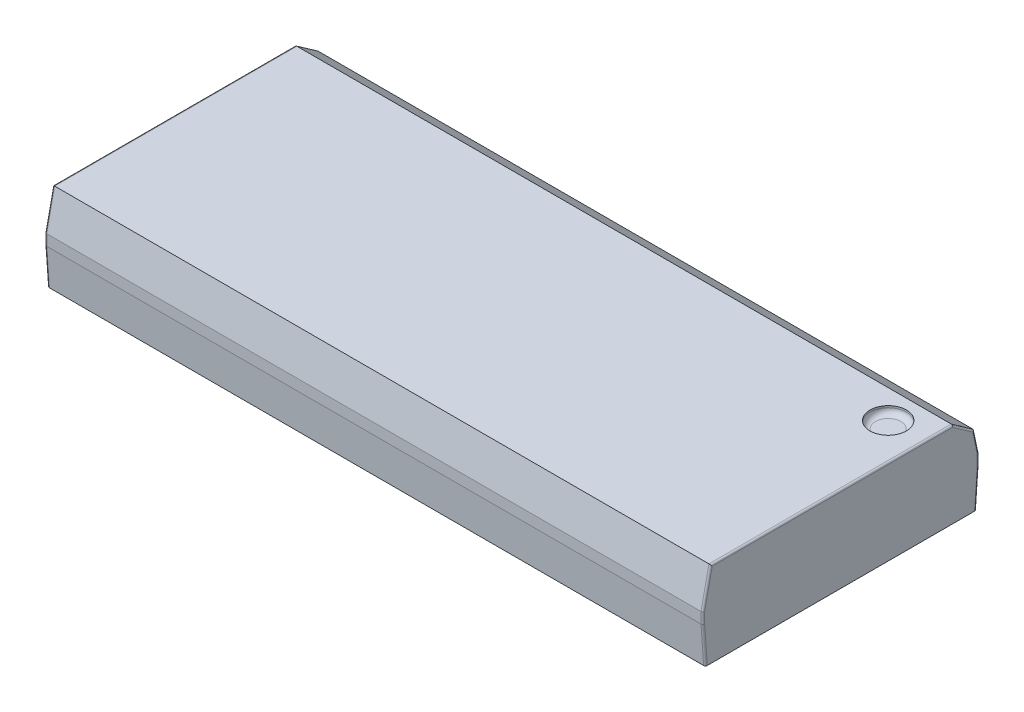
ISO-10303-21;
HEADER;
FILE_DESCRIPTION(('STEP AP214'),'2;1');
FILE_NAME('part.step','',(''),(''),'','','');
FILE_SCHEMA(('AUTOMOTIVE_DESIGN { 1 0 10303 214 1 1 1 1 }'));
ENDSEC;
DATA;
#1=APPLICATION_CONTEXT('core data for automotive mechanical design processes');
#2=APPLICATION_PROTOCOL_DEFINITION('international standard','automotive_design',2000,#1);
#3=PRODUCT_CONTEXT('',#1,'mechanical');
#4=PRODUCT('Part','Part','',(#3));
#5=PRODUCT_RELATED_PRODUCT_CATEGORY('part','',(#4));
#6=PRODUCT_DEFINITION_FORMATION('','',#4);
#7=PRODUCT_DEFINITION_CONTEXT('part definition',#1,'design');
#8=PRODUCT_DEFINITION('design','',#6,#7);
#9=PRODUCT_DEFINITION_SHAPE('','',#8);
#10=(LENGTH_UNIT() NAMED_UNIT(*) SI_UNIT(.MILLI.,.METRE.));
#11=(NAMED_UNIT(*) PLANE_ANGLE_UNIT() SI_UNIT($,.RADIAN.));
#12=(NAMED_UNIT(*) SI_UNIT($,.STERADIAN.) SOLID_ANGLE_UNIT());
#13=UNCERTAINTY_MEASURE_WITH_UNIT(LENGTH_MEASURE(1.E-05),#10,'distance_accuracy_value','');
#14=(GEOMETRIC_REPRESENTATION_CONTEXT(3) GLOBAL_UNCERTAINTY_ASSIGNED_CONTEXT((#13)) GLOBAL_UNIT_ASSIGNED_CONTEXT((#10,
#11,#12)) REPRESENTATION_CONTEXT('',''));
#15=CARTESIAN_POINT('',(0.,0.,0.));
#16=DIRECTION('',(0.,0.,1.));
#17=DIRECTION('',(1.,0.,0.));
#18=AXIS2_PLACEMENT_3D('',#15,#16,#17);
#19=CARTESIAN_POINT('',(8.05,0.975,-2.3));
#20=DIRECTION('',(0.,1.,0.));
#21=DIRECTION('',(0.,0.,1.));
#22=AXIS2_PLACEMENT_3D('',#19,#20,#21);
#23=PLANE('',#22);
#24=CARTESIAN_POINT('',(8.05,0.975,-2.3));
#25=DIRECTION('',(0.,-1.,0.));
#26=DIRECTION('',(0.,0.,-1.));
#27=AXIS2_PLACEMENT_3D('',#24,#25,#26);
#28=CIRCLE('',#27,0.350000000000004);
#29=CARTESIAN_POINT('',(8.05,0.975,-1.95));
#30=VERTEX_POINT('',#29);
#31=CARTESIAN_POINT('',(8.05,0.975,-2.65));
#32=VERTEX_POINT('',#31);
#33=EDGE_CURVE('E283',#30,#32,#28,.F.);
#34=ORIENTED_EDGE('',*,*,#33,.T.);
#35=CARTESIAN_POINT('',(8.05,0.975,-2.3));
#36=DIRECTION('',(0.,-1.,0.));
#37=DIRECTION('',(0.,0.,1.));
#38=AXIS2_PLACEMENT_3D('',#35,#36,#37);
#39=CIRCLE('',#38,0.350000000000005);
#40=EDGE_CURVE('E285',#32,#30,#39,.F.);
#41=ORIENTED_EDGE('',*,*,#40,.T.);
#42=EDGE_LOOP('',(#34,#41));
#43=FACE_BOUND('',#42,.T.);
#44=ADVANCED_FACE('F17',(#43),#23,.T.);
#45=CARTESIAN_POINT('',(8.05,1.125,-2.3));
#46=DIRECTION('',(0.,1.,0.));
#47=DIRECTION('',(0.,0.,1.));
#48=AXIS2_PLACEMENT_3D('',#45,#46,#47);
#49=TOROIDAL_SURFACE('',#48,0.350000000000004,0.15);
#50=CARTESIAN_POINT('',(8.05,1.125,-2.3));
#51=DIRECTION('',(0.,1.,0.));
#52=DIRECTION('',(0.,0.,1.));
#53=AXIS2_PLACEMENT_3D('',#50,#51,#52);
#54=CIRCLE('',#53,0.500000000000004);
#55=CARTESIAN_POINT('',(8.05,1.125,-1.8));
#56=VERTEX_POINT('',#55);
#57=EDGE_CURVE('E192',#56,#56,#54,.T.);
#58=ORIENTED_EDGE('',*,*,#57,.T.);
#59=EDGE_LOOP('',(#58));
#60=FACE_BOUND('',#59,.T.);
#61=ORIENTED_EDGE('',*,*,#40,.F.);
#62=ORIENTED_EDGE('',*,*,#33,.F.);
#63=EDGE_LOOP('',(#61,#62));
#64=FACE_BOUND('',#63,.T.);
#65=ADVANCED_FACE('F196',(#60,#64),#49,.F.);
#66=CARTESIAN_POINT('',(8.05,0.975,-2.3));
#67=DIRECTION('',(0.,1.,0.));
#68=DIRECTION('',(0.,0.,1.));
#69=AXIS2_PLACEMENT_3D('',#66,#67,#68);
#70=CYLINDRICAL_SURFACE('',#69,0.500000000000004);
#71=CARTESIAN_POINT('',(8.05,1.175,-2.3));
#72=DIRECTION('',(0.,1.,0.));
#73=DIRECTION('',(0.,0.,1.));
#74=AXIS2_PLACEMENT_3D('',#71,#72,#73);
#75=CIRCLE('',#74,0.500000000000004);
#76=CARTESIAN_POINT('',(8.05,1.175,-1.8));
#77=VERTEX_POINT('',#76);
#78=EDGE_CURVE('E179',#77,#77,#75,.F.);
#79=ORIENTED_EDGE('',*,*,#78,.F.);
#80=EDGE_LOOP('',(#79));
#81=FACE_BOUND('',#80,.T.);
#82=ORIENTED_EDGE('',*,*,#57,.F.);
#83=EDGE_LOOP('',(#82));
#84=FACE_BOUND('',#83,.T.);
#85=ADVANCED_FACE('F200',(#81,#84),#70,.F.);
#86=CARTESIAN_POINT('',(-9.05,1.175,-3.08212952428822));
#87=DIRECTION('',(0.,0.819152044288992,-0.573576436351045));
#88=DIRECTION('',(0.,0.573576436351045,0.819152044288992));
#89=AXIS2_PLACEMENT_3D('',#86,#87,#88);
#90=PLANE('',#89);
#91=DIRECTION('',(1.,0.,0.));
#92=VECTOR('',#91,1.);
#93=CARTESIAN_POINT('',(-9.05,1.175,-3.08212952428822));
#94=LINE('',#93,#92);
#95=CARTESIAN_POINT('',(9.00000000000001,1.175,-3.08212952428822));
#96=VERTEX_POINT('',#95);
#97=CARTESIAN_POINT('',(-9.,1.175,-3.08212952428822));
#98=VERTEX_POINT('',#97);
#99=EDGE_CURVE('E176',#96,#98,#94,.F.);
#100=ORIENTED_EDGE('',*,*,#99,.F.);
#101=DIRECTION('',(0.,0.573576436351045,0.819152044288992));
#102=VECTOR('',#101,1.);
#103=CARTESIAN_POINT('',(9.00000000000001,1.175,-3.08212952428822));
#104=LINE('',#103,#102);
#105=CARTESIAN_POINT('',(9.00000000000001,0.763677592272502,-3.66955880101262));
#106=VERTEX_POINT('',#105);
#107=EDGE_CURVE('E187',#96,#106,#104,.F.);
#108=ORIENTED_EDGE('',*,*,#107,.T.);
#109=DIRECTION('',(1.,0.,0.));
#110=VECTOR('',#109,1.);
#111=CARTESIAN_POINT('',(-9.05,0.763677592272502,-3.66955880101262));
#112=LINE('',#111,#110);
#113=CARTESIAN_POINT('',(-9.,0.763677592272502,-3.66955880101262));
#114=VERTEX_POINT('',#113);
#115=EDGE_CURVE('E184',#106,#114,#112,.F.);
#116=ORIENTED_EDGE('',*,*,#115,.T.);
#117=DIRECTION('',(0.,0.573576436351045,0.819152044288992));
#118=VECTOR('',#117,1.);
#119=CARTESIAN_POINT('',(-9.,1.175,-3.08212952428822));
#120=LINE('',#119,#118);
#121=EDGE_CURVE('E190',#114,#98,#120,.T.);
#122=ORIENTED_EDGE('',*,*,#121,.T.);
#123=EDGE_LOOP('',(#100,#108,#116,#122));
#124=FACE_BOUND('',#123,.T.);
#125=ADVANCED_FACE('F308',(#124),#90,.T.);
#126=CARTESIAN_POINT('',(-9.05,1.175,-3.58212952428823));
#127=DIRECTION('',(0.,-0.207911690817757,0.978147600733806));
#128=DIRECTION('',(0.,-0.978147600733806,-0.207911690817757));
#129=AXIS2_PLACEMENT_3D('',#126,#127,#128);
#130=PLANE('',#129);
#131=DIRECTION('',(0.,-0.978147600733806,-0.207911690817757));
#132=VECTOR('',#131,1.);
#133=CARTESIAN_POINT('',(-9.,1.175,-3.58212952428823));
#134=LINE('',#133,#132);
#135=CARTESIAN_POINT('',(-9.,0.149999999999988,-3.8));
#136=VERTEX_POINT('',#135);
#137=EDGE_CURVE('E182',#114,#136,#134,.T.);
#138=ORIENTED_EDGE('',*,*,#137,.F.);
#139=ORIENTED_EDGE('',*,*,#115,.F.);
#140=DIRECTION('',(0.,-0.978147600733806,-0.207911690817757));
#141=VECTOR('',#140,1.);
#142=CARTESIAN_POINT('',(9.,-1.11772386568823,-4.06946302603771));
#143=LINE('',#142,#141);
#144=CARTESIAN_POINT('',(9.,0.149999999999988,-3.8));
#145=VERTEX_POINT('',#144);
#146=EDGE_CURVE('E149',#145,#106,#143,.F.);
#147=ORIENTED_EDGE('',*,*,#146,.F.);
#148=DIRECTION('',(-1.,0.,0.));
#149=VECTOR('',#148,1.);
#150=CARTESIAN_POINT('',(-9.05,0.149999999999988,-3.8));
#151=LINE('',#150,#149);
#152=EDGE_CURVE('E171',#136,#145,#151,.F.);
#153=ORIENTED_EDGE('',*,*,#152,.F.);
#154=EDGE_LOOP('',(#138,#139,#147,#153));
#155=FACE_BOUND('',#154,.T.);
#156=ADVANCED_FACE('F314',(#155),#130,.F.);
#157=CARTESIAN_POINT('',(-9.05,1.175,3.8));
#158=DIRECTION('',(0.,1.,0.));
#159=DIRECTION('',(0.,0.,1.));
#160=AXIS2_PLACEMENT_3D('',#157,#158,#159);
#161=PLANE('',#160);
#162=DIRECTION('',(1.,0.,0.));
#163=VECTOR('',#162,1.);
#164=CARTESIAN_POINT('',(-9.05,1.175,3.58212952428823));
#165=LINE('',#164,#163);
#166=CARTESIAN_POINT('',(-9.,1.175,3.58212952428823));
#167=VERTEX_POINT('',#166);
#168=CARTESIAN_POINT('',(9.00000000000001,1.175,3.58212952428823));
#169=VERTEX_POINT('',#168);
#170=EDGE_CURVE('E165',#167,#169,#165,.T.);
#171=ORIENTED_EDGE('',*,*,#170,.T.);
#172=DIRECTION('',(0.,0.,-1.));
#173=VECTOR('',#172,1.);
#174=CARTESIAN_POINT('',(9.00000000000001,1.175,3.8));
#175=LINE('',#174,#173);
#176=EDGE_CURVE('E161',#96,#169,#175,.F.);
#177=ORIENTED_EDGE('',*,*,#176,.F.);
#178=ORIENTED_EDGE('',*,*,#99,.T.);
#179=DIRECTION('',(0.,0.,1.));
#180=VECTOR('',#179,1.);
#181=CARTESIAN_POINT('',(-9.,1.175,3.8));
#182=LINE('',#181,#180);
#183=EDGE_CURVE('E265',#167,#98,#182,.F.);
#184=ORIENTED_EDGE('',*,*,#183,.F.);
#185=EDGE_LOOP('',(#171,#177,#178,#184));
#186=FACE_BOUND('',#185,.T.);
#187=ORIENTED_EDGE('',*,*,#78,.T.);
#188=EDGE_LOOP('',(#187));
#189=FACE_BOUND('',#188,.T.);
#190=ADVANCED_FACE('F409',(#186,#189),#161,.T.);
#191=CARTESIAN_POINT('',(-9.05,1.175,3.58212952428823));
#192=DIRECTION('',(0.,-0.207911690817757,-0.978147600733806));
#193=DIRECTION('',(0.,0.978147600733806,-0.207911690817757));
#194=AXIS2_PLACEMENT_3D('',#191,#192,#193);
#195=PLANE('',#194);
#196=DIRECTION('',(0.,-0.978147600733806,0.207911690817757));
#197=VECTOR('',#196,1.);
#198=CARTESIAN_POINT('',(-9.,0.427875377999797,3.7409357650796));
#199=LINE('',#198,#197);
#200=CARTESIAN_POINT('',(-9.,0.149999999999991,3.8));
#201=VERTEX_POINT('',#200);
#202=EDGE_CURVE('E269',#201,#167,#199,.F.);
#203=ORIENTED_EDGE('',*,*,#202,.F.);
#204=DIRECTION('',(1.,0.,0.));
#205=VECTOR('',#204,1.);
#206=CARTESIAN_POINT('',(-9.05,0.149999999999988,3.8));
#207=LINE('',#206,#205);
#208=CARTESIAN_POINT('',(9.,0.149999999999988,3.8));
#209=VERTEX_POINT('',#208);
#210=EDGE_CURVE('E166',#209,#201,#207,.F.);
#211=ORIENTED_EDGE('',*,*,#210,.F.);
#212=DIRECTION('',(0.,0.978147600733806,-0.207911690817757));
#213=VECTOR('',#212,1.);
#214=CARTESIAN_POINT('',(9.,0.427875377999797,3.7409357650796));
#215=LINE('',#214,#213);
#216=EDGE_CURVE('E271',#169,#209,#215,.F.);
#217=ORIENTED_EDGE('',*,*,#216,.F.);
#218=ORIENTED_EDGE('',*,*,#170,.F.);
#219=EDGE_LOOP('',(#203,#211,#217,#218));
#220=FACE_BOUND('',#219,.T.);
#221=ADVANCED_FACE('F405',(#220),#195,.F.);
#222=CARTESIAN_POINT('',(9.,-1.175,3.75));
#223=DIRECTION('',(0.,1.,0.));
#224=DIRECTION('',(0.,0.,1.));
#225=AXIS2_PLACEMENT_3D('',#222,#223,#224);
#226=CYLINDRICAL_SURFACE('',#225,0.0500000000000001);
#227=CARTESIAN_POINT('',(9.,0.144744788236704,3.75));
#228=DIRECTION('',(0.,0.994521895368273,-0.104528463267652));
#229=DIRECTION('',(0.,-0.104528463267652,-0.994521895368273));
#230=AXIS2_PLACEMENT_3D('',#227,#228,#229);
#231=ELLIPSE('',#230,0.0502754139781759,0.0500000000000001);
#232=CARTESIAN_POINT('',(9.05,0.144744788236703,3.75));
#233=VERTEX_POINT('',#232);
#234=EDGE_CURVE('E275',#209,#233,#231,.T.);
#235=ORIENTED_EDGE('',*,*,#234,.F.);
#236=DIRECTION('',(0.,1.,0.));
#237=VECTOR('',#236,1.);
#238=CARTESIAN_POINT('',(9.,-1.175,3.8));
#239=LINE('',#238,#237);
#240=CARTESIAN_POINT('',(9.,-0.149999999999946,3.8));
#241=VERTEX_POINT('',#240);
#242=EDGE_CURVE('E250',#241,#209,#239,.T.);
#243=ORIENTED_EDGE('',*,*,#242,.F.);
#244=CARTESIAN_POINT('',(9.,-0.148253961525348,3.75));
#245=DIRECTION('',(0.,-0.999390827019096,-0.0348994967024992));
#246=DIRECTION('',(0.,0.0348994967024971,-0.999390827019096));
#247=AXIS2_PLACEMENT_3D('',#244,#245,#246);
#248=ELLIPSE('',#247,0.0500304772149412,0.0500000000000001);
#249=CARTESIAN_POINT('',(9.05,-0.148253961525368,3.75));
#250=VERTEX_POINT('',#249);
#251=EDGE_CURVE('E247',#250,#241,#248,.T.);
#252=ORIENTED_EDGE('',*,*,#251,.F.);
#253=DIRECTION('',(0.,1.,0.));
#254=VECTOR('',#253,1.);
#255=CARTESIAN_POINT('',(9.05,-1.175,3.75));
#256=LINE('',#255,#254);
#257=EDGE_CURVE('E249',#233,#250,#256,.F.);
#258=ORIENTED_EDGE('',*,*,#257,.F.);
#259=EDGE_LOOP('',(#235,#243,#252,#258));
#260=FACE_BOUND('',#259,.T.);
#261=ADVANCED_FACE('F402',(#260),#226,.T.);
#262=CARTESIAN_POINT('',(9.,-1.12811945022911,-4.02055564600102));
#263=DIRECTION('',(0.,-0.978147600733806,-0.207911690817757));
#264=DIRECTION('',(0.,0.207911690817757,-0.978147600733806));
#265=AXIS2_PLACEMENT_3D('',#262,#263,#264);
#266=CYLINDRICAL_SURFACE('',#265,0.0500000000000001);
#267=CARTESIAN_POINT('',(9.,0.734016878400281,-3.62474635062672));
#268=DIRECTION('',(0.,0.833885822067169,0.551936985312057));
#269=DIRECTION('',(0.,-0.551936985312057,0.833885822067169));
#270=AXIS2_PLACEMENT_3D('',#267,#268,#269);
#271=ELLIPSE('',#270,0.0537393120257227,0.0500000000000001);
#272=CARTESIAN_POINT('',(9.05,0.734016878400281,-3.62474635062672));
#273=VERTEX_POINT('',#272);
#274=EDGE_CURVE('E147',#273,#106,#271,.T.);
#275=ORIENTED_EDGE('',*,*,#274,.F.);
#276=DIRECTION('',(0.,0.978147600733806,0.207911690817757));
#277=VECTOR('',#276,1.);
#278=CARTESIAN_POINT('',(9.05,0.144744788236703,-3.75));
#279=LINE('',#278,#277);
#280=CARTESIAN_POINT('',(9.05,0.144744788236699,-3.75));
#281=VERTEX_POINT('',#280);
#282=EDGE_CURVE('E133',#281,#273,#279,.T.);
#283=ORIENTED_EDGE('',*,*,#282,.F.);
#284=CARTESIAN_POINT('',(9.,0.144744788236703,-3.75));
#285=DIRECTION('',(0.,0.994521895368273,0.104528463267652));
#286=DIRECTION('',(0.,0.104528463267652,-0.994521895368273));
#287=AXIS2_PLACEMENT_3D('',#284,#285,#286);
#288=ELLIPSE('',#287,0.0502754139781759,0.0500000000000001);
#289=EDGE_CURVE('E175',#145,#281,#288,.F.);
#290=ORIENTED_EDGE('',*,*,#289,.F.);
#291=ORIENTED_EDGE('',*,*,#146,.T.);
#292=EDGE_LOOP('',(#275,#283,#290,#291));
#293=FACE_BOUND('',#292,.T.);
#294=ADVANCED_FACE('F148',(#293),#266,.T.);
#295=CARTESIAN_POINT('',(9.,0.0236272718400006,-4.63928785124611));
#296=DIRECTION('',(0.,0.573576436351045,0.819152044288992));
#297=DIRECTION('',(0.,-0.819152044288992,0.573576436351045));
#298=AXIS2_PLACEMENT_3D('',#295,#296,#297);
#299=CYLINDRICAL_SURFACE('',#298,0.05);
#300=CARTESIAN_POINT('',(9.00000000000001,1.125,-3.06636458484427));
#301=DIRECTION('',(0.,-0.300705799504273,-0.953716950748227));
#302=DIRECTION('',(0.,0.953716950748227,-0.300705799504272));
#303=AXIS2_PLACEMENT_3D('',#300,#301,#302);
#304=ELLIPSE('',#303,0.0524264562570404,0.0499999999999998);
#305=CARTESIAN_POINT('',(9.05,1.125,-3.06636458484427));
#306=VERTEX_POINT('',#305);
#307=EDGE_CURVE('E151',#306,#96,#304,.F.);
#308=ORIENTED_EDGE('',*,*,#307,.F.);
#309=DIRECTION('',(0.,0.573576436351046,0.819152044288992));
#310=VECTOR('',#309,1.);
#311=CARTESIAN_POINT('',(9.05,0.734016878400281,-3.62474635062672));
#312=LINE('',#311,#310);
#313=EDGE_CURVE('E137',#273,#306,#312,.T.);
#314=ORIENTED_EDGE('',*,*,#313,.F.);
#315=ORIENTED_EDGE('',*,*,#274,.T.);
#316=ORIENTED_EDGE('',*,*,#107,.F.);
#317=EDGE_LOOP('',(#308,#314,#315,#316));
#318=FACE_BOUND('',#317,.T.);
#319=ADVANCED_FACE('F153',(#318),#299,.T.);
#320=CARTESIAN_POINT('',(9.00000000000001,1.125,3.8));
#321=DIRECTION('',(0.,0.,-1.));
#322=DIRECTION('',(-1.,0.,0.));
#323=AXIS2_PLACEMENT_3D('',#320,#321,#322);
#324=CYLINDRICAL_SURFACE('',#323,0.0499999999999997);
#325=ORIENTED_EDGE('',*,*,#307,.T.);
#326=ORIENTED_EDGE('',*,*,#176,.T.);
#327=CARTESIAN_POINT('',(9.00000000000001,1.125,3.54164032262848));
#328=DIRECTION('',(0.,0.629320391049839,-0.77714596145697));
#329=DIRECTION('',(0.,0.77714596145697,0.629320391049839));
#330=AXIS2_PLACEMENT_3D('',#327,#328,#329);
#331=ELLIPSE('',#330,0.0643379782946583,0.0499999999999999);
#332=CARTESIAN_POINT('',(9.05,1.125,3.54164032262848));
#333=VERTEX_POINT('',#332);
#334=EDGE_CURVE('E272',#333,#169,#331,.F.);
#335=ORIENTED_EDGE('',*,*,#334,.F.);
#336=DIRECTION('',(0.,0.,-1.));
#337=VECTOR('',#336,1.);
#338=CARTESIAN_POINT('',(9.05,1.125,-3.8));
#339=LINE('',#338,#337);
#340=EDGE_CURVE('E156',#306,#333,#339,.F.);
#341=ORIENTED_EDGE('',*,*,#340,.F.);
#342=EDGE_LOOP('',(#325,#326,#335,#341));
#343=FACE_BOUND('',#342,.T.);
#344=ADVANCED_FACE('F393',(#343),#324,.T.);
#345=CARTESIAN_POINT('',(9.,0.417479793458909,3.69202838504291));
#346=DIRECTION('',(0.,0.978147600733806,-0.207911690817757));
#347=DIRECTION('',(0.,0.207911690817757,0.978147600733806));
#348=AXIS2_PLACEMENT_3D('',#345,#346,#347);
#349=CYLINDRICAL_SURFACE('',#348,0.0500000000000001);
#350=ORIENTED_EDGE('',*,*,#334,.T.);
#351=ORIENTED_EDGE('',*,*,#216,.T.);
#352=ORIENTED_EDGE('',*,*,#234,.T.);
#353=DIRECTION('',(0.,-0.978147600733806,0.207911690817756));
#354=VECTOR('',#353,1.);
#355=CARTESIAN_POINT('',(9.05,1.125,3.54164032262848));
#356=LINE('',#355,#354);
#357=EDGE_CURVE('E158',#333,#233,#356,.T.);
#358=ORIENTED_EDGE('',*,*,#357,.F.);
#359=EDGE_LOOP('',(#350,#351,#352,#358));
#360=FACE_BOUND('',#359,.T.);
#361=ADVANCED_FACE('F389',(#360),#349,.T.);
#362=CARTESIAN_POINT('',(9.,-1.175,-3.75));
#363=DIRECTION('',(0.,1.,0.));
#364=DIRECTION('',(0.,0.,1.));
#365=AXIS2_PLACEMENT_3D('',#362,#363,#364);
#366=CYLINDRICAL_SURFACE('',#365,0.0500000000000001);
#367=ORIENTED_EDGE('',*,*,#289,.T.);
#368=DIRECTION('',(0.,1.,0.));
#369=VECTOR('',#368,1.);
#370=CARTESIAN_POINT('',(9.05,-1.175,-3.75));
#371=LINE('',#370,#369);
#372=CARTESIAN_POINT('',(9.05,-0.148253961525368,-3.75));
#373=VERTEX_POINT('',#372);
#374=EDGE_CURVE('E141',#373,#281,#371,.T.);
#375=ORIENTED_EDGE('',*,*,#374,.F.);
#376=CARTESIAN_POINT('',(9.,-0.148253961525367,-3.75));
#377=DIRECTION('',(0.,0.999390827019096,-0.0348994967024992));
#378=DIRECTION('',(0.,-0.0348994967024971,-0.999390827019096));
#379=AXIS2_PLACEMENT_3D('',#376,#377,#378);
#380=ELLIPSE('',#379,0.0500304772149412,0.0500000000000001);
#381=CARTESIAN_POINT('',(9.,-0.149999999999953,-3.8));
#382=VERTEX_POINT('',#381);
#383=EDGE_CURVE('E244',#382,#373,#380,.F.);
#384=ORIENTED_EDGE('',*,*,#383,.F.);
#385=DIRECTION('',(0.,1.,0.));
#386=VECTOR('',#385,1.);
#387=CARTESIAN_POINT('',(9.,-1.175,-3.8));
#388=LINE('',#387,#386);
#389=EDGE_CURVE('E174',#145,#382,#388,.F.);
#390=ORIENTED_EDGE('',*,*,#389,.F.);
#391=EDGE_LOOP('',(#367,#375,#384,#390));
#392=FACE_BOUND('',#391,.T.);
#393=ADVANCED_FACE('F385',(#392),#366,.T.);
#394=CARTESIAN_POINT('',(-9.05,-1.175,-3.8));
#395=DIRECTION('',(0.,0.,-1.));
#396=DIRECTION('',(-1.,0.,0.));
#397=AXIS2_PLACEMENT_3D('',#394,#395,#396);
#398=PLANE('',#397);
#399=ORIENTED_EDGE('',*,*,#152,.T.);
#400=ORIENTED_EDGE('',*,*,#389,.T.);
#401=DIRECTION('',(1.,0.,0.));
#402=VECTOR('',#401,1.);
#403=CARTESIAN_POINT('',(-9.05,-0.149999999999957,-3.8));
#404=LINE('',#403,#402);
#405=CARTESIAN_POINT('',(-9.,-0.149999999999953,-3.8));
#406=VERTEX_POINT('',#405);
#407=EDGE_CURVE('E445',#406,#382,#404,.T.);
#408=ORIENTED_EDGE('',*,*,#407,.F.);
#409=DIRECTION('',(0.,1.,0.));
#410=VECTOR('',#409,1.);
#411=CARTESIAN_POINT('',(-9.,-1.175,-3.8));
#412=LINE('',#411,#410);
#413=EDGE_CURVE('E255',#136,#406,#412,.F.);
#414=ORIENTED_EDGE('',*,*,#413,.F.);
#415=EDGE_LOOP('',(#399,#400,#408,#414));
#416=FACE_BOUND('',#415,.T.);
#417=ADVANCED_FACE('F381',(#416),#398,.T.);
#418=CARTESIAN_POINT('',(-9.,0.417479793458909,3.69202838504291));
#419=DIRECTION('',(0.,-0.978147600733806,0.207911690817757));
#420=DIRECTION('',(0.,-0.207911690817757,-0.978147600733806));
#421=AXIS2_PLACEMENT_3D('',#418,#419,#420);
#422=CYLINDRICAL_SURFACE('',#421,0.0500000000000001);
#423=CARTESIAN_POINT('',(-9.,1.125,3.54164032262848));
#424=DIRECTION('',(0.,-0.629320391049839,0.77714596145697));
#425=DIRECTION('',(0.,0.77714596145697,0.629320391049839));
#426=AXIS2_PLACEMENT_3D('',#423,#424,#425);
#427=ELLIPSE('',#426,0.0643379782946583,0.0499999999999999);
#428=CARTESIAN_POINT('',(-9.05,1.125,3.54164032262848));
#429=VERTEX_POINT('',#428);
#430=EDGE_CURVE('E266',#429,#167,#427,.F.);
#431=ORIENTED_EDGE('',*,*,#430,.F.);
#432=DIRECTION('',(0.,0.978147600733806,-0.207911690817756));
#433=VECTOR('',#432,1.);
#434=CARTESIAN_POINT('',(-9.05,0.144744788236709,3.75));
#435=LINE('',#434,#433);
#436=CARTESIAN_POINT('',(-9.05,0.14474478823671,3.75));
#437=VERTEX_POINT('',#436);
#438=EDGE_CURVE('E450',#437,#429,#435,.T.);
#439=ORIENTED_EDGE('',*,*,#438,.F.);
#440=CARTESIAN_POINT('',(-9.,0.144744788236711,3.75));
#441=DIRECTION('',(0.,0.994521895368273,-0.104528463267652));
#442=DIRECTION('',(0.,0.104528463267652,0.994521895368273));
#443=AXIS2_PLACEMENT_3D('',#440,#441,#442);
#444=ELLIPSE('',#443,0.0502754139781759,0.0500000000000001);
#445=EDGE_CURVE('E170',#201,#437,#444,.F.);
#446=ORIENTED_EDGE('',*,*,#445,.F.);
#447=ORIENTED_EDGE('',*,*,#202,.T.);
#448=EDGE_LOOP('',(#431,#439,#446,#447));
#449=FACE_BOUND('',#448,.T.);
#450=ADVANCED_FACE('F377',(#449),#422,.T.);
#451=CARTESIAN_POINT('',(-9.,1.125,3.8));
#452=DIRECTION('',(0.,0.,1.));
#453=DIRECTION('',(1.,0.,0.));
#454=AXIS2_PLACEMENT_3D('',#451,#452,#453);
#455=CYLINDRICAL_SURFACE('',#454,0.0499999999999997);
#456=ORIENTED_EDGE('',*,*,#430,.T.);
#457=ORIENTED_EDGE('',*,*,#183,.T.);
#458=CARTESIAN_POINT('',(-9.,1.125,-3.06636458484427));
#459=DIRECTION('',(0.,-0.300705799504273,-0.953716950748227));
#460=DIRECTION('',(0.,-0.953716950748227,0.300705799504272));
#461=AXIS2_PLACEMENT_3D('',#458,#459,#460);
#462=ELLIPSE('',#461,0.0524264562570404,0.0499999999999998);
#463=CARTESIAN_POINT('',(-9.05,1.125,-3.06636458484427));
#464=VERTEX_POINT('',#463);
#465=EDGE_CURVE('E262',#464,#98,#462,.T.);
#466=ORIENTED_EDGE('',*,*,#465,.F.);
#467=DIRECTION('',(0.,0.,1.));
#468=VECTOR('',#467,1.);
#469=CARTESIAN_POINT('',(-9.05,1.125,-3.8));
#470=LINE('',#469,#468);
#471=EDGE_CURVE('E452',#429,#464,#470,.F.);
#472=ORIENTED_EDGE('',*,*,#471,.F.);
#473=EDGE_LOOP('',(#456,#457,#466,#472));
#474=FACE_BOUND('',#473,.T.);
#475=ADVANCED_FACE('F373',(#474),#455,.T.);
#476=CARTESIAN_POINT('',(-9.,0.0236272718400006,-4.63928785124611));
#477=DIRECTION('',(0.,-0.573576436351045,-0.819152044288992));
#478=DIRECTION('',(0.,0.819152044288992,-0.573576436351045));
#479=AXIS2_PLACEMENT_3D('',#476,#477,#478);
#480=CYLINDRICAL_SURFACE('',#479,0.05);
#481=ORIENTED_EDGE('',*,*,#465,.T.);
#482=ORIENTED_EDGE('',*,*,#121,.F.);
#483=CARTESIAN_POINT('',(-9.,0.734016878400281,-3.62474635062672));
#484=DIRECTION('',(0.,0.833885822067169,0.551936985312057));
#485=DIRECTION('',(0.,0.551936985312057,-0.833885822067169));
#486=AXIS2_PLACEMENT_3D('',#483,#484,#485);
#487=ELLIPSE('',#486,0.0537393120257227,0.0500000000000001);
#488=CARTESIAN_POINT('',(-9.05,0.734016878400281,-3.62474635062672));
#489=VERTEX_POINT('',#488);
#490=EDGE_CURVE('E259',#489,#114,#487,.F.);
#491=ORIENTED_EDGE('',*,*,#490,.F.);
#492=DIRECTION('',(0.,-0.573576436351045,-0.819152044288992));
#493=VECTOR('',#492,1.);
#494=CARTESIAN_POINT('',(-9.05,1.125,-3.06636458484427));
#495=LINE('',#494,#493);
#496=EDGE_CURVE('E456',#464,#489,#495,.T.);
#497=ORIENTED_EDGE('',*,*,#496,.F.);
#498=EDGE_LOOP('',(#481,#482,#491,#497));
#499=FACE_BOUND('',#498,.T.);
#500=ADVANCED_FACE('F369',(#499),#480,.T.);
#501=CARTESIAN_POINT('',(-9.,-1.12811945022911,-4.02055564600102));
#502=DIRECTION('',(0.,0.978147600733806,0.207911690817757));
#503=DIRECTION('',(0.,-0.207911690817757,0.978147600733806));
#504=AXIS2_PLACEMENT_3D('',#501,#502,#503);
#505=CYLINDRICAL_SURFACE('',#504,0.0500000000000001);
#506=ORIENTED_EDGE('',*,*,#490,.T.);
#507=ORIENTED_EDGE('',*,*,#137,.T.);
#508=CARTESIAN_POINT('',(-9.,0.144744788236703,-3.75));
#509=DIRECTION('',(0.,0.994521895368273,0.104528463267652));
#510=DIRECTION('',(0.,0.104528463267652,-0.994521895368273));
#511=AXIS2_PLACEMENT_3D('',#508,#509,#510);
#512=ELLIPSE('',#511,0.0502754139781759,0.0500000000000001);
#513=CARTESIAN_POINT('',(-9.05,0.144744788236703,-3.75));
#514=VERTEX_POINT('',#513);
#515=EDGE_CURVE('E256',#514,#136,#512,.F.);
#516=ORIENTED_EDGE('',*,*,#515,.F.);
#517=DIRECTION('',(0.,-0.978147600733806,-0.207911690817756));
#518=VECTOR('',#517,1.);
#519=CARTESIAN_POINT('',(-9.05,0.734016878400281,-3.62474635062672));
#520=LINE('',#519,#518);
#521=EDGE_CURVE('E425',#489,#514,#520,.T.);
#522=ORIENTED_EDGE('',*,*,#521,.F.);
#523=EDGE_LOOP('',(#506,#507,#516,#522));
#524=FACE_BOUND('',#523,.T.);
#525=ADVANCED_FACE('F365',(#524),#505,.T.);
#526=CARTESIAN_POINT('',(-9.,-1.175,-3.75));
#527=DIRECTION('',(0.,1.,0.));
#528=DIRECTION('',(0.,0.,1.));
#529=AXIS2_PLACEMENT_3D('',#526,#527,#528);
#530=CYLINDRICAL_SURFACE('',#529,0.0500000000000001);
#531=ORIENTED_EDGE('',*,*,#515,.T.);
#532=ORIENTED_EDGE('',*,*,#413,.T.);
#533=CARTESIAN_POINT('',(-9.,-0.148253961525367,-3.75));
#534=DIRECTION('',(0.,-0.999390827019096,0.0348994967024992));
#535=DIRECTION('',(0.,0.0348994967024971,0.999390827019096));
#536=AXIS2_PLACEMENT_3D('',#533,#534,#535);
#537=ELLIPSE('',#536,0.0500304772149412,0.0500000000000001);
#538=CARTESIAN_POINT('',(-9.05,-0.148253961525388,-3.75));
#539=VERTEX_POINT('',#538);
#540=EDGE_CURVE('E240',#539,#406,#537,.T.);
#541=ORIENTED_EDGE('',*,*,#540,.F.);
#542=DIRECTION('',(0.,1.,0.));
#543=VECTOR('',#542,1.);
#544=CARTESIAN_POINT('',(-9.05,-1.175,-3.75));
#545=LINE('',#544,#543);
#546=EDGE_CURVE('E459',#514,#539,#545,.F.);
#547=ORIENTED_EDGE('',*,*,#546,.F.);
#548=EDGE_LOOP('',(#531,#532,#541,#547));
#549=FACE_BOUND('',#548,.T.);
#550=ADVANCED_FACE('F361',(#549),#530,.T.);
#551=CARTESIAN_POINT('',(-9.,-1.175,3.75));
#552=DIRECTION('',(0.,1.,0.));
#553=DIRECTION('',(0.,0.,1.));
#554=AXIS2_PLACEMENT_3D('',#551,#552,#553);
#555=CYLINDRICAL_SURFACE('',#554,0.0500000000000001);
#556=ORIENTED_EDGE('',*,*,#445,.T.);
#557=DIRECTION('',(0.,1.,0.));
#558=VECTOR('',#557,1.);
#559=CARTESIAN_POINT('',(-9.05,-1.175,3.75));
#560=LINE('',#559,#558);
#561=CARTESIAN_POINT('',(-9.05,-0.148253961525357,3.75));
#562=VERTEX_POINT('',#561);
#563=EDGE_CURVE('E239',#562,#437,#560,.T.);
#564=ORIENTED_EDGE('',*,*,#563,.F.);
#565=CARTESIAN_POINT('',(-9.,-0.14825396152537,3.75));
#566=DIRECTION('',(0.,0.999390827019096,0.0348994967024992));
#567=DIRECTION('',(0.,-0.0348994967024971,0.999390827019096));
#568=AXIS2_PLACEMENT_3D('',#565,#566,#567);
#569=ELLIPSE('',#568,0.0500304772149412,0.0500000000000001);
#570=CARTESIAN_POINT('',(-9.00000000000001,-0.149999999999954,3.8));
#571=VERTEX_POINT('',#570);
#572=EDGE_CURVE('E233',#571,#562,#569,.F.);
#573=ORIENTED_EDGE('',*,*,#572,.F.);
#574=DIRECTION('',(0.,1.,0.));
#575=VECTOR('',#574,1.);
#576=CARTESIAN_POINT('',(-9.,-1.175,3.8));
#577=LINE('',#576,#575);
#578=EDGE_CURVE('E169',#201,#571,#577,.F.);
#579=ORIENTED_EDGE('',*,*,#578,.F.);
#580=EDGE_LOOP('',(#556,#564,#573,#579));
#581=FACE_BOUND('',#580,.T.);
#582=ADVANCED_FACE('F357',(#581),#555,.T.);
#583=CARTESIAN_POINT('',(-9.05,-1.175,3.8));
#584=DIRECTION('',(0.,0.,1.));
#585=DIRECTION('',(1.,0.,0.));
#586=AXIS2_PLACEMENT_3D('',#583,#584,#585);
#587=PLANE('',#586);
#588=DIRECTION('',(1.,0.,0.));
#589=VECTOR('',#588,1.);
#590=CARTESIAN_POINT('',(-9.05,-0.149999999999957,3.8));
#591=LINE('',#590,#589);
#592=EDGE_CURVE('E232',#241,#571,#591,.F.);
#593=ORIENTED_EDGE('',*,*,#592,.F.);
#594=ORIENTED_EDGE('',*,*,#242,.T.);
#595=ORIENTED_EDGE('',*,*,#210,.T.);
#596=ORIENTED_EDGE('',*,*,#578,.T.);
#597=EDGE_LOOP('',(#593,#594,#595,#596));
#598=FACE_BOUND('',#597,.T.);
#599=ADVANCED_FACE('F353',(#598),#587,.T.);
#600=CARTESIAN_POINT('',(9.,-1.69538234519107,3.64181424446295));
#601=DIRECTION('',(0.,-0.997564050259825,-0.0697564737441217));
#602=DIRECTION('',(0.,0.0697564737441217,-0.997564050259825));
#603=AXIS2_PLACEMENT_3D('',#600,#601,#602);
#604=CYLINDRICAL_SURFACE('',#603,0.0500000000000001);
#605=ORIENTED_EDGE('',*,*,#251,.T.);
#606=DIRECTION('',(0.,-0.997564050259825,-0.0697564737441217));
#607=VECTOR('',#606,1.);
#608=CARTESIAN_POINT('',(9.,-0.149999999999957,3.8));
#609=LINE('',#608,#607);
#610=CARTESIAN_POINT('',(9.,-1.175,3.7283250177579));
#611=VERTEX_POINT('',#610);
#612=EDGE_CURVE('E230',#611,#241,#609,.F.);
#613=ORIENTED_EDGE('',*,*,#612,.F.);
#614=CARTESIAN_POINT('',(9.,-1.175,3.67820292285384));
#615=DIRECTION('',(0.,1.,0.));
#616=DIRECTION('',(0.,0.,-1.));
#617=AXIS2_PLACEMENT_3D('',#614,#615,#616);
#618=ELLIPSE('',#617,0.0501220949040587,0.0500000000000001);
#619=CARTESIAN_POINT('',(9.05,-1.175,3.67820292285384));
#620=VERTEX_POINT('',#619);
#621=EDGE_CURVE('E227',#611,#620,#618,.T.);
#622=ORIENTED_EDGE('',*,*,#621,.T.);
#623=DIRECTION('',(0.,-0.997564050259825,-0.0697564737441224));
#624=VECTOR('',#623,1.);
#625=CARTESIAN_POINT('',(9.05,-0.148253961525357,3.75));
#626=LINE('',#625,#624);
#627=EDGE_CURVE('E439',#250,#620,#626,.T.);
#628=ORIENTED_EDGE('',*,*,#627,.F.);
#629=EDGE_LOOP('',(#605,#613,#622,#628));
#630=FACE_BOUND('',#629,.T.);
#631=ADVANCED_FACE('F350',(#630),#604,.T.);
#632=CARTESIAN_POINT('',(9.05,-1.175,-3.8));
#633=DIRECTION('',(1.,0.,0.));
#634=DIRECTION('',(0.,0.,-1.));
#635=AXIS2_PLACEMENT_3D('',#632,#633,#634);
#636=PLANE('',#635);
#637=ORIENTED_EDGE('',*,*,#340,.T.);
#638=ORIENTED_EDGE('',*,*,#357,.T.);
#639=ORIENTED_EDGE('',*,*,#257,.T.);
#640=ORIENTED_EDGE('',*,*,#627,.T.);
#641=DIRECTION('',(0.,0.,1.));
#642=VECTOR('',#641,1.);
#643=CARTESIAN_POINT('',(9.05,-1.175,3.8));
#644=LINE('',#643,#642);
#645=CARTESIAN_POINT('',(9.05,-1.175,-3.67820292285384));
#646=VERTEX_POINT('',#645);
#647=EDGE_CURVE('E226',#620,#646,#644,.F.);
#648=ORIENTED_EDGE('',*,*,#647,.T.);
#649=DIRECTION('',(0.,0.997564050259825,-0.0697564737441217));
#650=VECTOR('',#649,1.);
#651=CARTESIAN_POINT('',(9.05,-1.16652456154285,-3.67879558324498));
#652=LINE('',#651,#650);
#653=EDGE_CURVE('E246',#373,#646,#652,.F.);
#654=ORIENTED_EDGE('',*,*,#653,.F.);
#655=ORIENTED_EDGE('',*,*,#374,.T.);
#656=ORIENTED_EDGE('',*,*,#282,.T.);
#657=ORIENTED_EDGE('',*,*,#313,.T.);
#658=EDGE_LOOP('',(#637,#638,#639,#640,#648,#654,#655,#656,#657));
#659=FACE_BOUND('',#658,.T.);
#660=ADVANCED_FACE('F135',(#659),#636,.T.);
#661=CARTESIAN_POINT('',(9.,-1.16652456154285,-3.67879558324498));
#662=DIRECTION('',(0.,0.997564050259825,-0.0697564737441217));
#663=DIRECTION('',(0.,0.0697564737441217,0.997564050259825));
#664=AXIS2_PLACEMENT_3D('',#661,#662,#663);
#665=CYLINDRICAL_SURFACE('',#664,0.0500000000000001);
#666=ORIENTED_EDGE('',*,*,#383,.T.);
#667=ORIENTED_EDGE('',*,*,#653,.T.);
#668=CARTESIAN_POINT('',(9.,-1.175,-3.67820292285384));
#669=DIRECTION('',(0.,1.,0.));
#670=DIRECTION('',(0.,0.,-1.));
#671=AXIS2_PLACEMENT_3D('',#668,#669,#670);
#672=ELLIPSE('',#671,0.0501220949040587,0.0500000000000001);
#673=CARTESIAN_POINT('',(9.,-1.175,-3.7283250177579));
#674=VERTEX_POINT('',#673);
#675=EDGE_CURVE('E223',#646,#674,#672,.T.);
#676=ORIENTED_EDGE('',*,*,#675,.T.);
#677=DIRECTION('',(0.,0.997564050259825,-0.0697564737441217));
#678=VECTOR('',#677,1.);
#679=CARTESIAN_POINT('',(9.,-0.149999999999957,-3.8));
#680=LINE('',#679,#678);
#681=EDGE_CURVE('E243',#382,#674,#680,.F.);
#682=ORIENTED_EDGE('',*,*,#681,.F.);
#683=EDGE_LOOP('',(#666,#667,#676,#682));
#684=FACE_BOUND('',#683,.T.);
#685=ADVANCED_FACE('F343',(#684),#665,.T.);
#686=CARTESIAN_POINT('',(-9.05,-0.149999999999957,-3.8));
#687=DIRECTION('',(0.,-0.0697564737441217,-0.997564050259825));
#688=DIRECTION('',(0.,0.997564050259825,-0.0697564737441217));
#689=AXIS2_PLACEMENT_3D('',#686,#687,#688);
#690=PLANE('',#689);
#691=ORIENTED_EDGE('',*,*,#407,.T.);
#692=ORIENTED_EDGE('',*,*,#681,.T.);
#693=DIRECTION('',(1.,0.,0.));
#694=VECTOR('',#693,1.);
#695=CARTESIAN_POINT('',(-9.05,-1.175,-3.7283250177579));
#696=LINE('',#695,#694);
#697=CARTESIAN_POINT('',(-9.00000000000001,-1.175,-3.7283250177579));
#698=VERTEX_POINT('',#697);
#699=EDGE_CURVE('E222',#674,#698,#696,.F.);
#700=ORIENTED_EDGE('',*,*,#699,.T.);
#701=DIRECTION('',(0.,0.997564050259825,-0.0697564737441217));
#702=VECTOR('',#701,1.);
#703=CARTESIAN_POINT('',(-9.00000000000001,-0.149999999999957,-3.8));
#704=LINE('',#703,#702);
#705=EDGE_CURVE('E237',#406,#698,#704,.F.);
#706=ORIENTED_EDGE('',*,*,#705,.F.);
#707=EDGE_LOOP('',(#691,#692,#700,#706));
#708=FACE_BOUND('',#707,.T.);
#709=ADVANCED_FACE('F339',(#708),#690,.T.);
#710=CARTESIAN_POINT('',(-9.,-1.16652456154285,-3.67879558324498));
#711=DIRECTION('',(0.,-0.997564050259825,0.0697564737441217));
#712=DIRECTION('',(0.,-0.0697564737441217,-0.997564050259825));
#713=AXIS2_PLACEMENT_3D('',#710,#711,#712);
#714=CYLINDRICAL_SURFACE('',#713,0.0500000000000001);
#715=ORIENTED_EDGE('',*,*,#540,.T.);
#716=ORIENTED_EDGE('',*,*,#705,.T.);
#717=CARTESIAN_POINT('',(-9.,-1.175,-3.67820292285384));
#718=DIRECTION('',(0.,1.,0.));
#719=DIRECTION('',(0.,0.,1.));
#720=AXIS2_PLACEMENT_3D('',#717,#718,#719);
#721=ELLIPSE('',#720,0.0501220949040587,0.0500000000000001);
#722=CARTESIAN_POINT('',(-9.05,-1.175,-3.67820292285384));
#723=VERTEX_POINT('',#722);
#724=EDGE_CURVE('E219',#698,#723,#721,.T.);
#725=ORIENTED_EDGE('',*,*,#724,.T.);
#726=DIRECTION('',(0.,-0.997564050259825,0.0697564737441216));
#727=VECTOR('',#726,1.);
#728=CARTESIAN_POINT('',(-9.05,-0.14825396152537,-3.75));
#729=LINE('',#728,#727);
#730=EDGE_CURVE('E236',#539,#723,#729,.T.);
#731=ORIENTED_EDGE('',*,*,#730,.F.);
#732=EDGE_LOOP('',(#715,#716,#725,#731));
#733=FACE_BOUND('',#732,.T.);
#734=ADVANCED_FACE('F335',(#733),#714,.T.);
#735=CARTESIAN_POINT('',(-9.05,-1.175,-3.8));
#736=DIRECTION('',(-1.,0.,0.));
#737=DIRECTION('',(0.,0.,1.));
#738=AXIS2_PLACEMENT_3D('',#735,#736,#737);
#739=PLANE('',#738);
#740=ORIENTED_EDGE('',*,*,#546,.T.);
#741=ORIENTED_EDGE('',*,*,#730,.T.);
#742=DIRECTION('',(0.,0.,1.));
#743=VECTOR('',#742,1.);
#744=CARTESIAN_POINT('',(-9.05,-1.175,3.8));
#745=LINE('',#744,#743);
#746=CARTESIAN_POINT('',(-9.05,-1.175,3.67820292285384));
#747=VERTEX_POINT('',#746);
#748=EDGE_CURVE('E218',#723,#747,#745,.T.);
#749=ORIENTED_EDGE('',*,*,#748,.T.);
#750=DIRECTION('',(0.,0.997564050259825,0.0697564737441217));
#751=VECTOR('',#750,1.);
#752=CARTESIAN_POINT('',(-9.05,-1.69538234519107,3.64181424446295));
#753=LINE('',#752,#751);
#754=EDGE_CURVE('E235',#562,#747,#753,.F.);
#755=ORIENTED_EDGE('',*,*,#754,.F.);
#756=ORIENTED_EDGE('',*,*,#563,.T.);
#757=ORIENTED_EDGE('',*,*,#438,.T.);
#758=ORIENTED_EDGE('',*,*,#471,.T.);
#759=ORIENTED_EDGE('',*,*,#496,.T.);
#760=ORIENTED_EDGE('',*,*,#521,.T.);
#761=EDGE_LOOP('',(#740,#741,#749,#755,#756,#757,#758,#759,#760));
#762=FACE_BOUND('',#761,.T.);
#763=ADVANCED_FACE('F331',(#762),#739,.T.);
#764=CARTESIAN_POINT('',(-9.,-1.69538234519107,3.64181424446295));
#765=DIRECTION('',(0.,0.997564050259825,0.0697564737441217));
#766=DIRECTION('',(0.,-0.0697564737441217,0.997564050259825));
#767=AXIS2_PLACEMENT_3D('',#764,#765,#766);
#768=CYLINDRICAL_SURFACE('',#767,0.0500000000000001);
#769=ORIENTED_EDGE('',*,*,#572,.T.);
#770=ORIENTED_EDGE('',*,*,#754,.T.);
#771=CARTESIAN_POINT('',(-9.,-1.175,3.67820292285384));
#772=DIRECTION('',(0.,1.,0.));
#773=DIRECTION('',(0.,0.,1.));
#774=AXIS2_PLACEMENT_3D('',#771,#772,#773);
#775=ELLIPSE('',#774,0.0501220949040587,0.0500000000000001);
#776=CARTESIAN_POINT('',(-9.00000000000001,-1.175,3.7283250177579));
#777=VERTEX_POINT('',#776);
#778=EDGE_CURVE('E28',#747,#777,#775,.T.);
#779=ORIENTED_EDGE('',*,*,#778,.T.);
#780=DIRECTION('',(0.,-0.997564050259825,-0.0697564737441217));
#781=VECTOR('',#780,1.);
#782=CARTESIAN_POINT('',(-9.00000000000001,-0.149999999999957,3.8));
#783=LINE('',#782,#781);
#784=EDGE_CURVE('E36',#571,#777,#783,.T.);
#785=ORIENTED_EDGE('',*,*,#784,.F.);
#786=EDGE_LOOP('',(#769,#770,#779,#785));
#787=FACE_BOUND('',#786,.T.);
#788=ADVANCED_FACE('F325',(#787),#768,.T.);
#789=CARTESIAN_POINT('',(-9.05,-0.149999999999957,3.8));
#790=DIRECTION('',(0.,-0.0697564737441217,0.997564050259825));
#791=DIRECTION('',(0.,-0.997564050259825,-0.0697564737441217));
#792=AXIS2_PLACEMENT_3D('',#789,#790,#791);
#793=PLANE('',#792);
#794=DIRECTION('',(1.,0.,0.));
#795=VECTOR('',#794,1.);
#796=CARTESIAN_POINT('',(-9.05,-1.175,3.7283250177579));
#797=LINE('',#796,#795);
#798=EDGE_CURVE('E10',#777,#611,#797,.T.);
#799=ORIENTED_EDGE('',*,*,#798,.T.);
#800=ORIENTED_EDGE('',*,*,#612,.T.);
#801=ORIENTED_EDGE('',*,*,#592,.T.);
#802=ORIENTED_EDGE('',*,*,#784,.T.);
#803=EDGE_LOOP('',(#799,#800,#801,#802));
#804=FACE_BOUND('',#803,.T.);
#805=ADVANCED_FACE('F319',(#804),#793,.T.);
#806=CARTESIAN_POINT('',(-9.05,-1.175,3.8));
#807=DIRECTION('',(0.,1.,0.));
#808=DIRECTION('',(0.,0.,1.));
#809=AXIS2_PLACEMENT_3D('',#806,#807,#808);
#810=PLANE('',#809);
#811=ORIENTED_EDGE('',*,*,#778,.F.);
#812=ORIENTED_EDGE('',*,*,#748,.F.);
#813=ORIENTED_EDGE('',*,*,#724,.F.);
#814=ORIENTED_EDGE('',*,*,#699,.F.);
#815=ORIENTED_EDGE('',*,*,#675,.F.);
#816=ORIENTED_EDGE('',*,*,#647,.F.);
#817=ORIENTED_EDGE('',*,*,#621,.F.);
#818=ORIENTED_EDGE('',*,*,#798,.F.);
#819=EDGE_LOOP('',(#811,#812,#813,#814,#815,#816,#817,#818));
#820=FACE_BOUND('',#819,.T.);
#821=ADVANCED_FACE('F317',(#820),#810,.F.);
#822=CLOSED_SHELL('',(#44,#65,#85,#125,#156,#190,#221,#261,#294,#319,#344,#361,#393,#417,#450,
#475,#500,#525,#550,#582,#599,#631,#660,#685,#709,#734,#763,#788,#805,#821));
#823=MANIFOLD_SOLID_BREP('B1',#822);
#824=ADVANCED_BREP_SHAPE_REPRESENTATION('',(#18,#823),#14);
#825=SHAPE_DEFINITION_REPRESENTATION(#9,#824);
ENDSEC;
END-ISO-10303-21;
